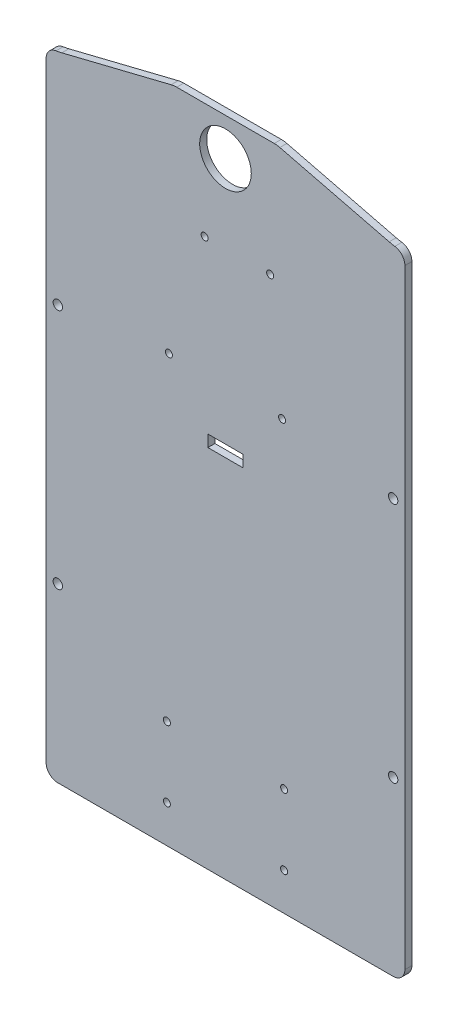
ISO-10303-21;
HEADER;
FILE_DESCRIPTION(('STEP AP214'),'2;1');
FILE_NAME('part.step','',(''),(''),'','','');
FILE_SCHEMA(('AUTOMOTIVE_DESIGN { 1 0 10303 214 1 1 1 1 }'));
ENDSEC;
DATA;
#1=APPLICATION_CONTEXT('core data for automotive mechanical design processes');
#2=APPLICATION_PROTOCOL_DEFINITION('international standard','automotive_design',2000,#1);
#3=PRODUCT_CONTEXT('',#1,'mechanical');
#4=PRODUCT('Part','Part','',(#3));
#5=PRODUCT_RELATED_PRODUCT_CATEGORY('part','',(#4));
#6=PRODUCT_DEFINITION_FORMATION('','',#4);
#7=PRODUCT_DEFINITION_CONTEXT('part definition',#1,'design');
#8=PRODUCT_DEFINITION('design','',#6,#7);
#9=PRODUCT_DEFINITION_SHAPE('','',#8);
#10=(LENGTH_UNIT() NAMED_UNIT(*) SI_UNIT(.MILLI.,.METRE.));
#11=(NAMED_UNIT(*) PLANE_ANGLE_UNIT() SI_UNIT($,.RADIAN.));
#12=(NAMED_UNIT(*) SI_UNIT($,.STERADIAN.) SOLID_ANGLE_UNIT());
#13=UNCERTAINTY_MEASURE_WITH_UNIT(LENGTH_MEASURE(1.E-05),#10,'distance_accuracy_value','');
#14=(GEOMETRIC_REPRESENTATION_CONTEXT(3) GLOBAL_UNCERTAINTY_ASSIGNED_CONTEXT((#13)) GLOBAL_UNIT_ASSIGNED_CONTEXT((#10,
#11,#12)) REPRESENTATION_CONTEXT('',''));
#15=CARTESIAN_POINT('',(0.,0.,0.));
#16=DIRECTION('',(0.,0.,1.));
#17=DIRECTION('',(1.,0.,0.));
#18=AXIS2_PLACEMENT_3D('',#15,#16,#17);
#19=CARTESIAN_POINT('',(76.5,135.,3.));
#20=DIRECTION('',(-1.,0.,0.));
#21=DIRECTION('',(0.,-1.,0.));
#22=AXIS2_PLACEMENT_3D('',#19,#20,#21);
#23=PLANE('',#22);
#24=DIRECTION('',(0.,1.,0.));
#25=VECTOR('',#24,1.);
#26=CARTESIAN_POINT('',(76.5,135.,3.));
#27=LINE('',#26,#25);
#28=CARTESIAN_POINT('',(76.5,-130.,3.));
#29=VERTEX_POINT('',#28);
#30=CARTESIAN_POINT('',(76.5,130.,3.));
#31=VERTEX_POINT('',#30);
#32=EDGE_CURVE('E289',#29,#31,#27,.T.);
#33=ORIENTED_EDGE('',*,*,#32,.F.);
#34=DIRECTION('',(0.,0.,-1.));
#35=VECTOR('',#34,1.);
#36=CARTESIAN_POINT('',(76.5,-130.,3.));
#37=LINE('',#36,#35);
#38=CARTESIAN_POINT('',(76.5,-130.,0.));
#39=VERTEX_POINT('',#38);
#40=EDGE_CURVE('E355',#29,#39,#37,.T.);
#41=ORIENTED_EDGE('',*,*,#40,.T.);
#42=DIRECTION('',(0.,1.,0.));
#43=VECTOR('',#42,1.);
#44=CARTESIAN_POINT('',(76.5,135.,0.));
#45=LINE('',#44,#43);
#46=CARTESIAN_POINT('',(76.5,130.,0.));
#47=VERTEX_POINT('',#46);
#48=EDGE_CURVE('E285',#39,#47,#45,.T.);
#49=ORIENTED_EDGE('',*,*,#48,.T.);
#50=DIRECTION('',(0.,0.,-1.));
#51=VECTOR('',#50,1.);
#52=CARTESIAN_POINT('',(76.5,130.,3.));
#53=LINE('',#52,#51);
#54=EDGE_CURVE('E352',#47,#31,#53,.F.);
#55=ORIENTED_EDGE('',*,*,#54,.T.);
#56=EDGE_LOOP('',(#33,#41,#49,#55));
#57=FACE_BOUND('',#56,.T.);
#58=ADVANCED_FACE('F39',(#57),#23,.F.);
#59=CARTESIAN_POINT('',(-76.5,135.,3.));
#60=DIRECTION('',(1.,0.,0.));
#61=DIRECTION('',(0.,1.,0.));
#62=AXIS2_PLACEMENT_3D('',#59,#60,#61);
#63=PLANE('',#62);
#64=DIRECTION('',(0.,-1.,0.));
#65=VECTOR('',#64,1.);
#66=CARTESIAN_POINT('',(-76.5,135.,0.));
#67=LINE('',#66,#65);
#68=CARTESIAN_POINT('',(-76.5,130.,0.));
#69=VERTEX_POINT('',#68);
#70=CARTESIAN_POINT('',(-76.5,-130.,0.));
#71=VERTEX_POINT('',#70);
#72=EDGE_CURVE('E306',#69,#71,#67,.T.);
#73=ORIENTED_EDGE('',*,*,#72,.T.);
#74=DIRECTION('',(0.,0.,-1.));
#75=VECTOR('',#74,1.);
#76=CARTESIAN_POINT('',(-76.5,-130.,3.));
#77=LINE('',#76,#75);
#78=CARTESIAN_POINT('',(-76.5,-130.,3.));
#79=VERTEX_POINT('',#78);
#80=EDGE_CURVE('E336',#71,#79,#77,.F.);
#81=ORIENTED_EDGE('',*,*,#80,.T.);
#82=DIRECTION('',(0.,-1.,0.));
#83=VECTOR('',#82,1.);
#84=CARTESIAN_POINT('',(-76.5,135.,3.));
#85=LINE('',#84,#83);
#86=CARTESIAN_POINT('',(-76.5,130.,3.));
#87=VERTEX_POINT('',#86);
#88=EDGE_CURVE('E293',#87,#79,#85,.T.);
#89=ORIENTED_EDGE('',*,*,#88,.F.);
#90=DIRECTION('',(0.,0.,-1.));
#91=VECTOR('',#90,1.);
#92=CARTESIAN_POINT('',(-76.5,130.,3.));
#93=LINE('',#92,#91);
#94=EDGE_CURVE('E332',#87,#69,#93,.T.);
#95=ORIENTED_EDGE('',*,*,#94,.T.);
#96=EDGE_LOOP('',(#73,#81,#89,#95));
#97=FACE_BOUND('',#96,.T.);
#98=ADVANCED_FACE('F439',(#97),#63,.F.);
#99=CARTESIAN_POINT('',(-76.5,-135.,3.));
#100=DIRECTION('',(0.,1.,0.));
#101=DIRECTION('',(0.,0.,1.));
#102=AXIS2_PLACEMENT_3D('',#99,#100,#101);
#103=PLANE('',#102);
#104=DIRECTION('',(1.,0.,0.));
#105=VECTOR('',#104,1.);
#106=CARTESIAN_POINT('',(-76.5,-135.,3.));
#107=LINE('',#106,#105);
#108=CARTESIAN_POINT('',(-71.5,-135.,3.));
#109=VERTEX_POINT('',#108);
#110=CARTESIAN_POINT('',(71.5,-135.,3.));
#111=VERTEX_POINT('',#110);
#112=EDGE_CURVE('E298',#109,#111,#107,.T.);
#113=ORIENTED_EDGE('',*,*,#112,.F.);
#114=DIRECTION('',(0.,0.,-1.));
#115=VECTOR('',#114,1.);
#116=CARTESIAN_POINT('',(-71.5,-135.,3.));
#117=LINE('',#116,#115);
#118=CARTESIAN_POINT('',(-71.5,-135.,0.));
#119=VERTEX_POINT('',#118);
#120=EDGE_CURVE('E315',#109,#119,#117,.T.);
#121=ORIENTED_EDGE('',*,*,#120,.T.);
#122=DIRECTION('',(1.,0.,0.));
#123=VECTOR('',#122,1.);
#124=CARTESIAN_POINT('',(-76.5,-135.,0.));
#125=LINE('',#124,#123);
#126=CARTESIAN_POINT('',(71.5,-135.,0.));
#127=VERTEX_POINT('',#126);
#128=EDGE_CURVE('E294',#119,#127,#125,.T.);
#129=ORIENTED_EDGE('',*,*,#128,.T.);
#130=DIRECTION('',(0.,0.,-1.));
#131=VECTOR('',#130,1.);
#132=CARTESIAN_POINT('',(71.5,-135.,3.));
#133=LINE('',#132,#131);
#134=EDGE_CURVE('E302',#127,#111,#133,.F.);
#135=ORIENTED_EDGE('',*,*,#134,.T.);
#136=EDGE_LOOP('',(#113,#121,#129,#135));
#137=FACE_BOUND('',#136,.T.);
#138=ADVANCED_FACE('F445',(#137),#103,.F.);
#139=CARTESIAN_POINT('',(0.,0.,3.));
#140=DIRECTION('',(0.,0.,1.));
#141=DIRECTION('',(1.,0.,0.));
#142=AXIS2_PLACEMENT_3D('',#139,#140,#141);
#143=PLANE('',#142);
#144=CARTESIAN_POINT('',(25.,-89.0383951916944,3.));
#145=DIRECTION('',(0.,0.,1.));
#146=DIRECTION('',(1.,0.,0.));
#147=AXIS2_PLACEMENT_3D('',#144,#145,#146);
#148=CIRCLE('',#147,1.5);
#149=CARTESIAN_POINT('',(26.5,-89.0383951916944,3.));
#150=VERTEX_POINT('',#149);
#151=EDGE_CURVE('E759',#150,#150,#148,.T.);
#152=ORIENTED_EDGE('',*,*,#151,.F.);
#153=EDGE_LOOP('',(#152));
#154=FACE_BOUND('',#153,.T.);
#155=CARTESIAN_POINT('',(-25.,-119.038395191694,3.));
#156=DIRECTION('',(0.,0.,1.));
#157=DIRECTION('',(1.,0.,0.));
#158=AXIS2_PLACEMENT_3D('',#155,#156,#157);
#159=CIRCLE('',#158,1.5);
#160=CARTESIAN_POINT('',(-23.5,-119.038395191694,3.));
#161=VERTEX_POINT('',#160);
#162=EDGE_CURVE('E755',#161,#161,#159,.T.);
#163=ORIENTED_EDGE('',*,*,#162,.F.);
#164=EDGE_LOOP('',(#163));
#165=FACE_BOUND('',#164,.T.);
#166=CARTESIAN_POINT('',(25.,-119.038395191694,3.));
#167=DIRECTION('',(0.,0.,1.));
#168=DIRECTION('',(1.,0.,0.));
#169=AXIS2_PLACEMENT_3D('',#166,#167,#168);
#170=CIRCLE('',#169,1.5);
#171=CARTESIAN_POINT('',(26.5,-119.038395191694,3.));
#172=VERTEX_POINT('',#171);
#173=EDGE_CURVE('E747',#172,#172,#170,.T.);
#174=ORIENTED_EDGE('',*,*,#173,.F.);
#175=EDGE_LOOP('',(#174));
#176=FACE_BOUND('',#175,.T.);
#177=CARTESIAN_POINT('',(-25.,-89.0383951916944,3.));
#178=DIRECTION('',(0.,0.,1.));
#179=DIRECTION('',(1.,0.,0.));
#180=AXIS2_PLACEMENT_3D('',#177,#178,#179);
#181=CIRCLE('',#180,1.5);
#182=CARTESIAN_POINT('',(-23.5,-89.0383951916944,3.));
#183=VERTEX_POINT('',#182);
#184=EDGE_CURVE('E412',#183,#183,#181,.T.);
#185=ORIENTED_EDGE('',*,*,#184,.F.);
#186=EDGE_LOOP('',(#185));
#187=FACE_BOUND('',#186,.T.);
#188=DIRECTION('',(0.,-1.,0.));
#189=VECTOR('',#188,1.);
#190=CARTESIAN_POINT('',(-7.49999999999998,25.7976680121043,3.));
#191=LINE('',#190,#189);
#192=CARTESIAN_POINT('',(-7.49999999999998,25.7976680121043,3.));
#193=VERTEX_POINT('',#192);
#194=CARTESIAN_POINT('',(-7.49999999999998,20.7976680121043,3.));
#195=VERTEX_POINT('',#194);
#196=EDGE_CURVE('E57',#193,#195,#191,.T.);
#197=ORIENTED_EDGE('',*,*,#196,.F.);
#198=DIRECTION('',(-1.,0.,0.));
#199=VECTOR('',#198,1.);
#200=CARTESIAN_POINT('',(-7.49999999999998,25.7976680121043,3.));
#201=LINE('',#200,#199);
#202=CARTESIAN_POINT('',(7.50000000000001,25.7976680121043,3.));
#203=VERTEX_POINT('',#202);
#204=EDGE_CURVE('E187',#203,#193,#201,.T.);
#205=ORIENTED_EDGE('',*,*,#204,.F.);
#206=DIRECTION('',(0.,1.,0.));
#207=VECTOR('',#206,1.);
#208=CARTESIAN_POINT('',(7.50000000000001,25.7976680121043,3.));
#209=LINE('',#208,#207);
#210=CARTESIAN_POINT('',(7.50000000000002,20.7976680121043,3.));
#211=VERTEX_POINT('',#210);
#212=EDGE_CURVE('E191',#211,#203,#209,.T.);
#213=ORIENTED_EDGE('',*,*,#212,.F.);
#214=DIRECTION('',(1.,0.,0.));
#215=VECTOR('',#214,1.);
#216=CARTESIAN_POINT('',(-7.49999999999998,20.7976680121043,3.));
#217=LINE('',#216,#215);
#218=EDGE_CURVE('E203',#195,#211,#217,.T.);
#219=ORIENTED_EDGE('',*,*,#218,.F.);
#220=EDGE_LOOP('',(#197,#205,#213,#219));
#221=FACE_BOUND('',#220,.T.);
#222=CARTESIAN_POINT('',(-24.13,47.2200591996396,3.));
#223=DIRECTION('',(0.,0.,1.));
#224=DIRECTION('',(1.,0.,0.));
#225=AXIS2_PLACEMENT_3D('',#222,#223,#224);
#226=CIRCLE('',#225,1.5);
#227=CARTESIAN_POINT('',(-22.63,47.2200591996396,3.));
#228=VERTEX_POINT('',#227);
#229=EDGE_CURVE('E194',#228,#228,#226,.T.);
#230=ORIENTED_EDGE('',*,*,#229,.F.);
#231=EDGE_LOOP('',(#230));
#232=FACE_BOUND('',#231,.T.);
#233=CARTESIAN_POINT('',(24.13,47.2200591996397,3.));
#234=DIRECTION('',(0.,0.,1.));
#235=DIRECTION('',(1.,0.,0.));
#236=AXIS2_PLACEMENT_3D('',#233,#234,#235);
#237=CIRCLE('',#236,1.5);
#238=CARTESIAN_POINT('',(25.63,47.2200591996397,3.));
#239=VERTEX_POINT('',#238);
#240=EDGE_CURVE('E778',#239,#239,#237,.T.);
#241=ORIENTED_EDGE('',*,*,#240,.F.);
#242=EDGE_LOOP('',(#241));
#243=FACE_BOUND('',#242,.T.);
#244=CARTESIAN_POINT('',(19.05,98.0200591996396,3.));
#245=DIRECTION('',(0.,0.,1.));
#246=DIRECTION('',(1.,0.,0.));
#247=AXIS2_PLACEMENT_3D('',#244,#245,#246);
#248=CIRCLE('',#247,1.5);
#249=CARTESIAN_POINT('',(20.55,98.0200591996396,3.));
#250=VERTEX_POINT('',#249);
#251=EDGE_CURVE('E770',#250,#250,#248,.T.);
#252=ORIENTED_EDGE('',*,*,#251,.F.);
#253=EDGE_LOOP('',(#252));
#254=FACE_BOUND('',#253,.T.);
#255=CARTESIAN_POINT('',(-8.88999999999999,98.0200591996397,3.));
#256=DIRECTION('',(0.,0.,1.));
#257=DIRECTION('',(1.,0.,0.));
#258=AXIS2_PLACEMENT_3D('',#255,#256,#257);
#259=CIRCLE('',#258,1.5);
#260=CARTESIAN_POINT('',(-7.38999999999999,98.0200591996397,3.));
#261=VERTEX_POINT('',#260);
#262=EDGE_CURVE('E222',#261,#261,#259,.T.);
#263=ORIENTED_EDGE('',*,*,#262,.F.);
#264=EDGE_LOOP('',(#263));
#265=FACE_BOUND('',#264,.T.);
#266=CARTESIAN_POINT('',(0.,131.2375,3.));
#267=DIRECTION('',(0.,0.,1.));
#268=DIRECTION('',(1.,0.,0.));
#269=AXIS2_PLACEMENT_3D('',#266,#267,#268);
#270=CIRCLE('',#269,11.);
#271=CARTESIAN_POINT('',(11.,131.2375,3.));
#272=VERTEX_POINT('',#271);
#273=EDGE_CURVE('E221',#272,#272,#270,.T.);
#274=ORIENTED_EDGE('',*,*,#273,.F.);
#275=EDGE_LOOP('',(#274));
#276=FACE_BOUND('',#275,.T.);
#277=CARTESIAN_POINT('',(71.5,41.5,3.));
#278=DIRECTION('',(0.,0.,1.));
#279=DIRECTION('',(-1.,0.,0.));
#280=AXIS2_PLACEMENT_3D('',#277,#278,#279);
#281=CIRCLE('',#280,2.);
#282=CARTESIAN_POINT('',(69.5,41.5,3.));
#283=VERTEX_POINT('',#282);
#284=EDGE_CURVE('E256',#283,#283,#281,.T.);
#285=ORIENTED_EDGE('',*,*,#284,.F.);
#286=EDGE_LOOP('',(#285));
#287=FACE_BOUND('',#286,.T.);
#288=CARTESIAN_POINT('',(71.5,-61.5,3.));
#289=DIRECTION('',(0.,0.,1.));
#290=DIRECTION('',(1.,0.,0.));
#291=AXIS2_PLACEMENT_3D('',#288,#289,#290);
#292=CIRCLE('',#291,2.);
#293=CARTESIAN_POINT('',(73.5000000000001,-61.5,3.));
#294=VERTEX_POINT('',#293);
#295=EDGE_CURVE('E270',#294,#294,#292,.T.);
#296=ORIENTED_EDGE('',*,*,#295,.F.);
#297=EDGE_LOOP('',(#296));
#298=FACE_BOUND('',#297,.T.);
#299=CARTESIAN_POINT('',(-71.5,-61.5,3.));
#300=DIRECTION('',(0.,0.,1.));
#301=DIRECTION('',(-1.,0.,0.));
#302=AXIS2_PLACEMENT_3D('',#299,#300,#301);
#303=CIRCLE('',#302,2.);
#304=CARTESIAN_POINT('',(-73.5,-61.5,3.));
#305=VERTEX_POINT('',#304);
#306=EDGE_CURVE('E262',#305,#305,#303,.T.);
#307=ORIENTED_EDGE('',*,*,#306,.F.);
#308=EDGE_LOOP('',(#307));
#309=FACE_BOUND('',#308,.T.);
#310=CARTESIAN_POINT('',(-71.5,41.5,3.));
#311=DIRECTION('',(0.,0.,1.));
#312=DIRECTION('',(1.,0.,0.));
#313=AXIS2_PLACEMENT_3D('',#310,#311,#312);
#314=CIRCLE('',#313,2.);
#315=CARTESIAN_POINT('',(-69.5,41.5,3.));
#316=VERTEX_POINT('',#315);
#317=EDGE_CURVE('E261',#316,#316,#314,.T.);
#318=ORIENTED_EDGE('',*,*,#317,.F.);
#319=EDGE_LOOP('',(#318));
#320=FACE_BOUND('',#319,.T.);
#321=DIRECTION('',(-0.970773672969585,0.23999682470637,0.));
#322=VECTOR('',#321,1.);
#323=CARTESIAN_POINT('',(22.,147.2375,3.));
#324=LINE('',#323,#322);
#325=CARTESIAN_POINT('',(69.7938929549953,135.421787575015,3.));
#326=VERTEX_POINT('',#325);
#327=CARTESIAN_POINT('',(23.1821885090955,146.945236729696,3.));
#328=VERTEX_POINT('',#327);
#329=EDGE_CURVE('E231',#326,#328,#324,.T.);
#330=ORIENTED_EDGE('',*,*,#329,.T.);
#331=CARTESIAN_POINT('',(20.7822202620318,137.2375,3.));
#332=DIRECTION('',(0.,0.,1.));
#333=DIRECTION('',(1.,0.,0.));
#334=AXIS2_PLACEMENT_3D('',#331,#332,#333);
#335=CIRCLE('',#334,10.);
#336=CARTESIAN_POINT('',(20.7822202620318,147.2375,3.));
#337=VERTEX_POINT('',#336);
#338=EDGE_CURVE('E392',#328,#337,#335,.T.);
#339=ORIENTED_EDGE('',*,*,#338,.T.);
#340=DIRECTION('',(-1.,0.,0.));
#341=VECTOR('',#340,1.);
#342=CARTESIAN_POINT('',(22.,147.2375,3.));
#343=LINE('',#342,#341);
#344=CARTESIAN_POINT('',(-20.7822202620317,147.2375,3.));
#345=VERTEX_POINT('',#344);
#346=EDGE_CURVE('E247',#337,#345,#343,.T.);
#347=ORIENTED_EDGE('',*,*,#346,.T.);
#348=CARTESIAN_POINT('',(-20.7822202620317,137.2375,3.));
#349=DIRECTION('',(0.,0.,1.));
#350=DIRECTION('',(1.,0.,0.));
#351=AXIS2_PLACEMENT_3D('',#348,#349,#350);
#352=CIRCLE('',#351,10.);
#353=CARTESIAN_POINT('',(-23.1821885090955,146.945236729696,3.));
#354=VERTEX_POINT('',#353);
#355=EDGE_CURVE('E389',#345,#354,#352,.T.);
#356=ORIENTED_EDGE('',*,*,#355,.T.);
#357=DIRECTION('',(-0.970773672969585,-0.23999682470637,0.));
#358=VECTOR('',#357,1.);
#359=CARTESIAN_POINT('',(-22.,147.2375,3.));
#360=LINE('',#359,#358);
#361=CARTESIAN_POINT('',(-69.7938929549951,135.421787575015,3.));
#362=VERTEX_POINT('',#361);
#363=EDGE_CURVE('E240',#354,#362,#360,.T.);
#364=ORIENTED_EDGE('',*,*,#363,.T.);
#365=CARTESIAN_POINT('',(-75.7938135726544,159.691129399255,3.));
#366=DIRECTION('',(0.,0.,1.));
#367=DIRECTION('',(1.,0.,0.));
#368=AXIS2_PLACEMENT_3D('',#365,#366,#367);
#369=CIRCLE('',#368,25.);
#370=CARTESIAN_POINT('',(-72.2156355954424,134.948521566542,3.));
#371=VERTEX_POINT('',#370);
#372=EDGE_CURVE('E379',#362,#371,#369,.F.);
#373=ORIENTED_EDGE('',*,*,#372,.T.);
#374=CARTESIAN_POINT('',(-71.5,130.,3.));
#375=DIRECTION('',(0.,0.,1.));
#376=DIRECTION('',(1.,0.,0.));
#377=AXIS2_PLACEMENT_3D('',#374,#375,#376);
#378=CIRCLE('',#377,5.);
#379=EDGE_CURVE('E339',#371,#87,#378,.T.);
#380=ORIENTED_EDGE('',*,*,#379,.T.);
#381=ORIENTED_EDGE('',*,*,#88,.T.);
#382=CARTESIAN_POINT('',(-71.5,-130.,3.));
#383=DIRECTION('',(0.,0.,1.));
#384=DIRECTION('',(1.,0.,0.));
#385=AXIS2_PLACEMENT_3D('',#382,#383,#384);
#386=CIRCLE('',#385,5.);
#387=EDGE_CURVE('E349',#79,#109,#386,.T.);
#388=ORIENTED_EDGE('',*,*,#387,.T.);
#389=ORIENTED_EDGE('',*,*,#112,.T.);
#390=CARTESIAN_POINT('',(71.5,-130.,3.));
#391=DIRECTION('',(0.,0.,1.));
#392=DIRECTION('',(1.,0.,0.));
#393=AXIS2_PLACEMENT_3D('',#390,#391,#392);
#394=CIRCLE('',#393,5.);
#395=EDGE_CURVE('E346',#111,#29,#394,.T.);
#396=ORIENTED_EDGE('',*,*,#395,.T.);
#397=ORIENTED_EDGE('',*,*,#32,.T.);
#398=CARTESIAN_POINT('',(71.5,130.,3.));
#399=DIRECTION('',(0.,0.,1.));
#400=DIRECTION('',(1.,0.,0.));
#401=AXIS2_PLACEMENT_3D('',#398,#399,#400);
#402=CIRCLE('',#401,5.);
#403=CARTESIAN_POINT('',(72.2156355954424,134.948521566542,3.));
#404=VERTEX_POINT('',#403);
#405=EDGE_CURVE('E342',#31,#404,#402,.T.);
#406=ORIENTED_EDGE('',*,*,#405,.T.);
#407=CARTESIAN_POINT('',(75.7938135726546,159.691129399255,3.));
#408=DIRECTION('',(0.,0.,1.));
#409=DIRECTION('',(1.,0.,0.));
#410=AXIS2_PLACEMENT_3D('',#407,#408,#409);
#411=CIRCLE('',#410,25.);
#412=EDGE_CURVE('E376',#404,#326,#411,.F.);
#413=ORIENTED_EDGE('',*,*,#412,.T.);
#414=EDGE_LOOP('',(#330,#339,#347,#356,#364,#373,#380,#381,#388,#389,#396,#397,#406,#413));
#415=FACE_BOUND('',#414,.T.);
#416=ADVANCED_FACE('F503',(#154,#165,#176,#187,#221,#232,#243,#254,#265,#276,#287,#298,#309,
#320,#415),#143,.T.);
#417=CARTESIAN_POINT('',(0.,0.,0.));
#418=DIRECTION('',(0.,0.,1.));
#419=DIRECTION('',(1.,0.,0.));
#420=AXIS2_PLACEMENT_3D('',#417,#418,#419);
#421=PLANE('',#420);
#422=CARTESIAN_POINT('',(25.,-89.0383951916944,0.));
#423=DIRECTION('',(0.,0.,1.));
#424=DIRECTION('',(1.,0.,0.));
#425=AXIS2_PLACEMENT_3D('',#422,#423,#424);
#426=CIRCLE('',#425,1.5);
#427=CARTESIAN_POINT('',(26.5,-89.0383951916944,0.));
#428=VERTEX_POINT('',#427);
#429=EDGE_CURVE('E43',#428,#428,#426,.T.);
#430=ORIENTED_EDGE('',*,*,#429,.T.);
#431=EDGE_LOOP('',(#430));
#432=FACE_BOUND('',#431,.T.);
#433=CARTESIAN_POINT('',(-25.,-119.038395191694,0.));
#434=DIRECTION('',(0.,0.,1.));
#435=DIRECTION('',(1.,0.,0.));
#436=AXIS2_PLACEMENT_3D('',#433,#434,#435);
#437=CIRCLE('',#436,1.5);
#438=CARTESIAN_POINT('',(-23.5,-119.038395191694,0.));
#439=VERTEX_POINT('',#438);
#440=EDGE_CURVE('E415',#439,#439,#437,.T.);
#441=ORIENTED_EDGE('',*,*,#440,.T.);
#442=EDGE_LOOP('',(#441));
#443=FACE_BOUND('',#442,.T.);
#444=CARTESIAN_POINT('',(25.,-119.038395191694,0.));
#445=DIRECTION('',(0.,0.,1.));
#446=DIRECTION('',(1.,0.,0.));
#447=AXIS2_PLACEMENT_3D('',#444,#445,#446);
#448=CIRCLE('',#447,1.5);
#449=CARTESIAN_POINT('',(26.5,-119.038395191694,0.));
#450=VERTEX_POINT('',#449);
#451=EDGE_CURVE('E411',#450,#450,#448,.T.);
#452=ORIENTED_EDGE('',*,*,#451,.T.);
#453=EDGE_LOOP('',(#452));
#454=FACE_BOUND('',#453,.T.);
#455=CARTESIAN_POINT('',(-25.,-89.0383951916944,0.));
#456=DIRECTION('',(0.,0.,1.));
#457=DIRECTION('',(1.,0.,0.));
#458=AXIS2_PLACEMENT_3D('',#455,#456,#457);
#459=CIRCLE('',#458,1.5);
#460=CARTESIAN_POINT('',(-23.5,-89.0383951916944,0.));
#461=VERTEX_POINT('',#460);
#462=EDGE_CURVE('E407',#461,#461,#459,.T.);
#463=ORIENTED_EDGE('',*,*,#462,.T.);
#464=EDGE_LOOP('',(#463));
#465=FACE_BOUND('',#464,.T.);
#466=DIRECTION('',(-1.,0.,0.));
#467=VECTOR('',#466,1.);
#468=CARTESIAN_POINT('',(-7.49999999999998,25.7976680121043,0.));
#469=LINE('',#468,#467);
#470=CARTESIAN_POINT('',(7.50000000000001,25.7976680121043,0.));
#471=VERTEX_POINT('',#470);
#472=CARTESIAN_POINT('',(-7.49999999999998,25.7976680121043,0.));
#473=VERTEX_POINT('',#472);
#474=EDGE_CURVE('E175',#471,#473,#469,.T.);
#475=ORIENTED_EDGE('',*,*,#474,.T.);
#476=DIRECTION('',(0.,-1.,0.));
#477=VECTOR('',#476,1.);
#478=CARTESIAN_POINT('',(-7.49999999999998,25.7976680121043,0.));
#479=LINE('',#478,#477);
#480=CARTESIAN_POINT('',(-7.49999999999998,20.7976680121043,0.));
#481=VERTEX_POINT('',#480);
#482=EDGE_CURVE('E168',#473,#481,#479,.T.);
#483=ORIENTED_EDGE('',*,*,#482,.T.);
#484=DIRECTION('',(1.,0.,0.));
#485=VECTOR('',#484,1.);
#486=CARTESIAN_POINT('',(-7.49999999999998,20.7976680121043,0.));
#487=LINE('',#486,#485);
#488=CARTESIAN_POINT('',(7.50000000000002,20.7976680121043,0.));
#489=VERTEX_POINT('',#488);
#490=EDGE_CURVE('E178',#481,#489,#487,.T.);
#491=ORIENTED_EDGE('',*,*,#490,.T.);
#492=DIRECTION('',(0.,1.,0.));
#493=VECTOR('',#492,1.);
#494=CARTESIAN_POINT('',(7.50000000000001,25.7976680121043,0.));
#495=LINE('',#494,#493);
#496=EDGE_CURVE('E65',#489,#471,#495,.T.);
#497=ORIENTED_EDGE('',*,*,#496,.T.);
#498=EDGE_LOOP('',(#475,#483,#491,#497));
#499=FACE_BOUND('',#498,.T.);
#500=CARTESIAN_POINT('',(-24.13,47.2200591996396,0.));
#501=DIRECTION('',(0.,0.,1.));
#502=DIRECTION('',(1.,0.,0.));
#503=AXIS2_PLACEMENT_3D('',#500,#501,#502);
#504=CIRCLE('',#503,1.5);
#505=CARTESIAN_POINT('',(-22.63,47.2200591996396,0.));
#506=VERTEX_POINT('',#505);
#507=EDGE_CURVE('E781',#506,#506,#504,.T.);
#508=ORIENTED_EDGE('',*,*,#507,.T.);
#509=EDGE_LOOP('',(#508));
#510=FACE_BOUND('',#509,.T.);
#511=CARTESIAN_POINT('',(24.13,47.2200591996397,0.));
#512=DIRECTION('',(0.,0.,1.));
#513=DIRECTION('',(1.,0.,0.));
#514=AXIS2_PLACEMENT_3D('',#511,#512,#513);
#515=CIRCLE('',#514,1.5);
#516=CARTESIAN_POINT('',(25.63,47.2200591996397,0.));
#517=VERTEX_POINT('',#516);
#518=EDGE_CURVE('E774',#517,#517,#515,.T.);
#519=ORIENTED_EDGE('',*,*,#518,.T.);
#520=EDGE_LOOP('',(#519));
#521=FACE_BOUND('',#520,.T.);
#522=CARTESIAN_POINT('',(19.05,98.0200591996396,0.));
#523=DIRECTION('',(0.,0.,1.));
#524=DIRECTION('',(1.,0.,0.));
#525=AXIS2_PLACEMENT_3D('',#522,#523,#524);
#526=CIRCLE('',#525,1.5);
#527=CARTESIAN_POINT('',(20.55,98.0200591996396,0.));
#528=VERTEX_POINT('',#527);
#529=EDGE_CURVE('E226',#528,#528,#526,.T.);
#530=ORIENTED_EDGE('',*,*,#529,.T.);
#531=EDGE_LOOP('',(#530));
#532=FACE_BOUND('',#531,.T.);
#533=CARTESIAN_POINT('',(-8.88999999999999,98.0200591996397,0.));
#534=DIRECTION('',(0.,0.,1.));
#535=DIRECTION('',(1.,0.,0.));
#536=AXIS2_PLACEMENT_3D('',#533,#534,#535);
#537=CIRCLE('',#536,1.5);
#538=CARTESIAN_POINT('',(-7.38999999999999,98.0200591996397,0.));
#539=VERTEX_POINT('',#538);
#540=EDGE_CURVE('E217',#539,#539,#537,.T.);
#541=ORIENTED_EDGE('',*,*,#540,.T.);
#542=EDGE_LOOP('',(#541));
#543=FACE_BOUND('',#542,.T.);
#544=CARTESIAN_POINT('',(0.,131.2375,0.));
#545=DIRECTION('',(0.,0.,1.));
#546=DIRECTION('',(1.,0.,0.));
#547=AXIS2_PLACEMENT_3D('',#544,#545,#546);
#548=CIRCLE('',#547,11.);
#549=CARTESIAN_POINT('',(11.,131.2375,0.));
#550=VERTEX_POINT('',#549);
#551=EDGE_CURVE('E227',#550,#550,#548,.T.);
#552=ORIENTED_EDGE('',*,*,#551,.T.);
#553=EDGE_LOOP('',(#552));
#554=FACE_BOUND('',#553,.T.);
#555=CARTESIAN_POINT('',(71.5,41.5,0.));
#556=DIRECTION('',(0.,0.,1.));
#557=DIRECTION('',(-1.,0.,0.));
#558=AXIS2_PLACEMENT_3D('',#555,#556,#557);
#559=CIRCLE('',#558,2.);
#560=CARTESIAN_POINT('',(69.5,41.5,0.));
#561=VERTEX_POINT('',#560);
#562=EDGE_CURVE('E274',#561,#561,#559,.T.);
#563=ORIENTED_EDGE('',*,*,#562,.T.);
#564=EDGE_LOOP('',(#563));
#565=FACE_BOUND('',#564,.T.);
#566=CARTESIAN_POINT('',(71.5,-61.5,0.));
#567=DIRECTION('',(0.,0.,1.));
#568=DIRECTION('',(1.,0.,0.));
#569=AXIS2_PLACEMENT_3D('',#566,#567,#568);
#570=CIRCLE('',#569,2.);
#571=CARTESIAN_POINT('',(73.5000000000001,-61.5,0.));
#572=VERTEX_POINT('',#571);
#573=EDGE_CURVE('E266',#572,#572,#570,.T.);
#574=ORIENTED_EDGE('',*,*,#573,.T.);
#575=EDGE_LOOP('',(#574));
#576=FACE_BOUND('',#575,.T.);
#577=CARTESIAN_POINT('',(-71.5,-61.5,0.));
#578=DIRECTION('',(0.,0.,1.));
#579=DIRECTION('',(-1.,0.,0.));
#580=AXIS2_PLACEMENT_3D('',#577,#578,#579);
#581=CIRCLE('',#580,2.);
#582=CARTESIAN_POINT('',(-73.5,-61.5,0.));
#583=VERTEX_POINT('',#582);
#584=EDGE_CURVE('E257',#583,#583,#581,.T.);
#585=ORIENTED_EDGE('',*,*,#584,.T.);
#586=EDGE_LOOP('',(#585));
#587=FACE_BOUND('',#586,.T.);
#588=CARTESIAN_POINT('',(-71.5,41.5,0.));
#589=DIRECTION('',(0.,0.,1.));
#590=DIRECTION('',(1.,0.,0.));
#591=AXIS2_PLACEMENT_3D('',#588,#589,#590);
#592=CIRCLE('',#591,2.);
#593=CARTESIAN_POINT('',(-69.5,41.5,0.));
#594=VERTEX_POINT('',#593);
#595=EDGE_CURVE('E281',#594,#594,#592,.T.);
#596=ORIENTED_EDGE('',*,*,#595,.T.);
#597=EDGE_LOOP('',(#596));
#598=FACE_BOUND('',#597,.T.);
#599=DIRECTION('',(1.,0.,0.));
#600=VECTOR('',#599,1.);
#601=CARTESIAN_POINT('',(22.,147.2375,0.));
#602=LINE('',#601,#600);
#603=CARTESIAN_POINT('',(-20.7822202620317,147.2375,0.));
#604=VERTEX_POINT('',#603);
#605=CARTESIAN_POINT('',(20.7822202620318,147.2375,0.));
#606=VERTEX_POINT('',#605);
#607=EDGE_CURVE('E243',#604,#606,#602,.T.);
#608=ORIENTED_EDGE('',*,*,#607,.T.);
#609=CARTESIAN_POINT('',(20.7822202620318,137.2375,0.));
#610=DIRECTION('',(0.,0.,1.));
#611=DIRECTION('',(1.,0.,0.));
#612=AXIS2_PLACEMENT_3D('',#609,#610,#611);
#613=CIRCLE('',#612,10.);
#614=CARTESIAN_POINT('',(23.1821885090955,146.945236729696,0.));
#615=VERTEX_POINT('',#614);
#616=EDGE_CURVE('E49',#606,#615,#613,.F.);
#617=ORIENTED_EDGE('',*,*,#616,.T.);
#618=DIRECTION('',(0.970773672969586,-0.23999682470637,0.));
#619=VECTOR('',#618,1.);
#620=CARTESIAN_POINT('',(22.,147.2375,0.));
#621=LINE('',#620,#619);
#622=CARTESIAN_POINT('',(69.7938929549953,135.421787575015,0.));
#623=VERTEX_POINT('',#622);
#624=EDGE_CURVE('E239',#615,#623,#621,.T.);
#625=ORIENTED_EDGE('',*,*,#624,.T.);
#626=CARTESIAN_POINT('',(75.7938135726546,159.691129399255,0.));
#627=DIRECTION('',(0.,0.,1.));
#628=DIRECTION('',(1.,0.,0.));
#629=AXIS2_PLACEMENT_3D('',#626,#627,#628);
#630=CIRCLE('',#629,25.);
#631=CARTESIAN_POINT('',(72.2156355954424,134.948521566542,0.));
#632=VERTEX_POINT('',#631);
#633=EDGE_CURVE('E373',#623,#632,#630,.T.);
#634=ORIENTED_EDGE('',*,*,#633,.T.);
#635=CARTESIAN_POINT('',(71.5,130.,0.));
#636=DIRECTION('',(0.,0.,1.));
#637=DIRECTION('',(1.,0.,0.));
#638=AXIS2_PLACEMENT_3D('',#635,#636,#637);
#639=CIRCLE('',#638,5.);
#640=EDGE_CURVE('E323',#632,#47,#639,.F.);
#641=ORIENTED_EDGE('',*,*,#640,.T.);
#642=ORIENTED_EDGE('',*,*,#48,.F.);
#643=CARTESIAN_POINT('',(71.5,-130.,0.));
#644=DIRECTION('',(0.,0.,1.));
#645=DIRECTION('',(1.,0.,0.));
#646=AXIS2_PLACEMENT_3D('',#643,#644,#645);
#647=CIRCLE('',#646,5.);
#648=EDGE_CURVE('E326',#39,#127,#647,.F.);
#649=ORIENTED_EDGE('',*,*,#648,.T.);
#650=ORIENTED_EDGE('',*,*,#128,.F.);
#651=CARTESIAN_POINT('',(-71.5,-130.,0.));
#652=DIRECTION('',(0.,0.,1.));
#653=DIRECTION('',(1.,0.,0.));
#654=AXIS2_PLACEMENT_3D('',#651,#652,#653);
#655=CIRCLE('',#654,5.);
#656=EDGE_CURVE('E329',#119,#71,#655,.F.);
#657=ORIENTED_EDGE('',*,*,#656,.T.);
#658=ORIENTED_EDGE('',*,*,#72,.F.);
#659=CARTESIAN_POINT('',(-71.5,130.,0.));
#660=DIRECTION('',(0.,0.,1.));
#661=DIRECTION('',(1.,0.,0.));
#662=AXIS2_PLACEMENT_3D('',#659,#660,#661);
#663=CIRCLE('',#662,5.);
#664=CARTESIAN_POINT('',(-72.2156355954424,134.948521566542,0.));
#665=VERTEX_POINT('',#664);
#666=EDGE_CURVE('E319',#69,#665,#663,.F.);
#667=ORIENTED_EDGE('',*,*,#666,.T.);
#668=CARTESIAN_POINT('',(-75.7938135726544,159.691129399255,0.));
#669=DIRECTION('',(0.,0.,1.));
#670=DIRECTION('',(1.,0.,0.));
#671=AXIS2_PLACEMENT_3D('',#668,#669,#670);
#672=CIRCLE('',#671,25.);
#673=CARTESIAN_POINT('',(-69.7938929549951,135.421787575015,0.));
#674=VERTEX_POINT('',#673);
#675=EDGE_CURVE('E382',#665,#674,#672,.T.);
#676=ORIENTED_EDGE('',*,*,#675,.T.);
#677=DIRECTION('',(0.970773672969586,0.23999682470637,0.));
#678=VECTOR('',#677,1.);
#679=CARTESIAN_POINT('',(-22.,147.2375,0.));
#680=LINE('',#679,#678);
#681=CARTESIAN_POINT('',(-23.1821885090955,146.945236729696,0.));
#682=VERTEX_POINT('',#681);
#683=EDGE_CURVE('E235',#674,#682,#680,.T.);
#684=ORIENTED_EDGE('',*,*,#683,.T.);
#685=CARTESIAN_POINT('',(-20.7822202620317,137.2375,0.));
#686=DIRECTION('',(0.,0.,1.));
#687=DIRECTION('',(1.,0.,0.));
#688=AXIS2_PLACEMENT_3D('',#685,#686,#687);
#689=CIRCLE('',#688,10.);
#690=EDGE_CURVE('E402',#682,#604,#689,.F.);
#691=ORIENTED_EDGE('',*,*,#690,.T.);
#692=EDGE_LOOP('',(#608,#617,#625,#634,#641,#642,#649,#650,#657,#658,#667,#676,#684,#691));
#693=FACE_BOUND('',#692,.T.);
#694=ADVANCED_FACE('F183',(#432,#443,#454,#465,#499,#510,#521,#532,#543,#554,#565,#576,#587,
#598,#693),#421,.F.);
#695=CARTESIAN_POINT('',(-71.5,41.5,0.));
#696=DIRECTION('',(0.,0.,1.));
#697=DIRECTION('',(1.,0.,0.));
#698=AXIS2_PLACEMENT_3D('',#695,#696,#697);
#699=CYLINDRICAL_SURFACE('',#698,2.);
#700=ORIENTED_EDGE('',*,*,#595,.F.);
#701=EDGE_LOOP('',(#700));
#702=FACE_BOUND('',#701,.T.);
#703=ORIENTED_EDGE('',*,*,#317,.T.);
#704=EDGE_LOOP('',(#703));
#705=FACE_BOUND('',#704,.T.);
#706=ADVANCED_FACE('F543',(#702,#705),#699,.F.);
#707=CARTESIAN_POINT('',(-71.5,-61.5,0.));
#708=DIRECTION('',(0.,0.,1.));
#709=DIRECTION('',(1.,0.,0.));
#710=AXIS2_PLACEMENT_3D('',#707,#708,#709);
#711=CYLINDRICAL_SURFACE('',#710,2.);
#712=ORIENTED_EDGE('',*,*,#584,.F.);
#713=EDGE_LOOP('',(#712));
#714=FACE_BOUND('',#713,.T.);
#715=ORIENTED_EDGE('',*,*,#306,.T.);
#716=EDGE_LOOP('',(#715));
#717=FACE_BOUND('',#716,.T.);
#718=ADVANCED_FACE('F539',(#714,#717),#711,.F.);
#719=CARTESIAN_POINT('',(71.5,-61.5,0.));
#720=DIRECTION('',(0.,0.,1.));
#721=DIRECTION('',(1.,0.,0.));
#722=AXIS2_PLACEMENT_3D('',#719,#720,#721);
#723=CYLINDRICAL_SURFACE('',#722,2.);
#724=ORIENTED_EDGE('',*,*,#573,.F.);
#725=EDGE_LOOP('',(#724));
#726=FACE_BOUND('',#725,.T.);
#727=ORIENTED_EDGE('',*,*,#295,.T.);
#728=EDGE_LOOP('',(#727));
#729=FACE_BOUND('',#728,.T.);
#730=ADVANCED_FACE('F542',(#726,#729),#723,.F.);
#731=CARTESIAN_POINT('',(71.5,41.5,0.));
#732=DIRECTION('',(0.,0.,1.));
#733=DIRECTION('',(1.,0.,0.));
#734=AXIS2_PLACEMENT_3D('',#731,#732,#733);
#735=CYLINDRICAL_SURFACE('',#734,2.);
#736=ORIENTED_EDGE('',*,*,#562,.F.);
#737=EDGE_LOOP('',(#736));
#738=FACE_BOUND('',#737,.T.);
#739=ORIENTED_EDGE('',*,*,#284,.T.);
#740=EDGE_LOOP('',(#739));
#741=FACE_BOUND('',#740,.T.);
#742=ADVANCED_FACE('F455',(#738,#741),#735,.F.);
#743=CARTESIAN_POINT('',(-71.5,-130.,3.));
#744=DIRECTION('',(0.,0.,-1.));
#745=DIRECTION('',(-1.,0.,0.));
#746=AXIS2_PLACEMENT_3D('',#743,#744,#745);
#747=CYLINDRICAL_SURFACE('',#746,5.);
#748=ORIENTED_EDGE('',*,*,#387,.F.);
#749=ORIENTED_EDGE('',*,*,#80,.F.);
#750=ORIENTED_EDGE('',*,*,#656,.F.);
#751=ORIENTED_EDGE('',*,*,#120,.F.);
#752=EDGE_LOOP('',(#748,#749,#750,#751));
#753=FACE_BOUND('',#752,.T.);
#754=ADVANCED_FACE('F451',(#753),#747,.T.);
#755=CARTESIAN_POINT('',(71.5,-130.,3.));
#756=DIRECTION('',(0.,0.,-1.));
#757=DIRECTION('',(-1.,0.,0.));
#758=AXIS2_PLACEMENT_3D('',#755,#756,#757);
#759=CYLINDRICAL_SURFACE('',#758,5.);
#760=ORIENTED_EDGE('',*,*,#395,.F.);
#761=ORIENTED_EDGE('',*,*,#134,.F.);
#762=ORIENTED_EDGE('',*,*,#648,.F.);
#763=ORIENTED_EDGE('',*,*,#40,.F.);
#764=EDGE_LOOP('',(#760,#761,#762,#763));
#765=FACE_BOUND('',#764,.T.);
#766=ADVANCED_FACE('F454',(#765),#759,.T.);
#767=CARTESIAN_POINT('',(71.5,130.,3.));
#768=DIRECTION('',(0.,0.,-1.));
#769=DIRECTION('',(-1.,0.,0.));
#770=AXIS2_PLACEMENT_3D('',#767,#768,#769);
#771=CYLINDRICAL_SURFACE('',#770,5.);
#772=ORIENTED_EDGE('',*,*,#640,.F.);
#773=DIRECTION('',(0.,0.,-1.));
#774=VECTOR('',#773,1.);
#775=CARTESIAN_POINT('',(72.2156355954424,134.948521566542,3.));
#776=LINE('',#775,#774);
#777=EDGE_CURVE('E363',#632,#404,#776,.F.);
#778=ORIENTED_EDGE('',*,*,#777,.T.);
#779=ORIENTED_EDGE('',*,*,#405,.F.);
#780=ORIENTED_EDGE('',*,*,#54,.F.);
#781=EDGE_LOOP('',(#772,#778,#779,#780));
#782=FACE_BOUND('',#781,.T.);
#783=ADVANCED_FACE('F459',(#782),#771,.T.);
#784=CARTESIAN_POINT('',(-71.5,130.,3.));
#785=DIRECTION('',(0.,0.,-1.));
#786=DIRECTION('',(-1.,0.,0.));
#787=AXIS2_PLACEMENT_3D('',#784,#785,#786);
#788=CYLINDRICAL_SURFACE('',#787,5.);
#789=ORIENTED_EDGE('',*,*,#379,.F.);
#790=DIRECTION('',(0.,0.,-1.));
#791=VECTOR('',#790,1.);
#792=CARTESIAN_POINT('',(-72.2156355954424,134.948521566542,3.));
#793=LINE('',#792,#791);
#794=EDGE_CURVE('E370',#371,#665,#793,.T.);
#795=ORIENTED_EDGE('',*,*,#794,.T.);
#796=ORIENTED_EDGE('',*,*,#666,.F.);
#797=ORIENTED_EDGE('',*,*,#94,.F.);
#798=EDGE_LOOP('',(#789,#795,#796,#797));
#799=FACE_BOUND('',#798,.T.);
#800=ADVANCED_FACE('F463',(#799),#788,.T.);
#801=CARTESIAN_POINT('',(22.,147.2375,-143.522668614578));
#802=DIRECTION('',(0.23999682470637,0.970773672969586,0.));
#803=DIRECTION('',(-0.970773672969586,0.23999682470637,0.));
#804=AXIS2_PLACEMENT_3D('',#801,#802,#803);
#805=PLANE('',#804);
#806=ORIENTED_EDGE('',*,*,#624,.F.);
#807=DIRECTION('',(0.,0.,1.));
#808=VECTOR('',#807,1.);
#809=CARTESIAN_POINT('',(23.1821885090955,146.945236729696,-143.522668614578));
#810=LINE('',#809,#808);
#811=EDGE_CURVE('E385',#615,#328,#810,.T.);
#812=ORIENTED_EDGE('',*,*,#811,.T.);
#813=ORIENTED_EDGE('',*,*,#329,.F.);
#814=DIRECTION('',(0.,0.,1.));
#815=VECTOR('',#814,1.);
#816=CARTESIAN_POINT('',(69.7938929549953,135.421787575015,0.));
#817=LINE('',#816,#815);
#818=EDGE_CURVE('E359',#326,#623,#817,.F.);
#819=ORIENTED_EDGE('',*,*,#818,.T.);
#820=EDGE_LOOP('',(#806,#812,#813,#819));
#821=FACE_BOUND('',#820,.T.);
#822=ADVANCED_FACE('F467',(#821),#805,.T.);
#823=CARTESIAN_POINT('',(-22.,147.2375,-143.522668614578));
#824=DIRECTION('',(-0.23999682470637,0.970773672969586,0.));
#825=DIRECTION('',(-0.970773672969586,-0.23999682470637,0.));
#826=AXIS2_PLACEMENT_3D('',#823,#824,#825);
#827=PLANE('',#826);
#828=ORIENTED_EDGE('',*,*,#363,.F.);
#829=DIRECTION('',(0.,0.,1.));
#830=VECTOR('',#829,1.);
#831=CARTESIAN_POINT('',(-23.1821885090955,146.945236729696,-143.522668614578));
#832=LINE('',#831,#830);
#833=EDGE_CURVE('E11',#354,#682,#832,.F.);
#834=ORIENTED_EDGE('',*,*,#833,.T.);
#835=ORIENTED_EDGE('',*,*,#683,.F.);
#836=DIRECTION('',(0.,0.,1.));
#837=VECTOR('',#836,1.);
#838=CARTESIAN_POINT('',(-69.7938929549951,135.421787575015,3.));
#839=LINE('',#838,#837);
#840=EDGE_CURVE('E366',#674,#362,#839,.T.);
#841=ORIENTED_EDGE('',*,*,#840,.T.);
#842=EDGE_LOOP('',(#828,#834,#835,#841));
#843=FACE_BOUND('',#842,.T.);
#844=ADVANCED_FACE('F523',(#843),#827,.T.);
#845=CARTESIAN_POINT('',(22.,147.2375,-143.522668614578));
#846=DIRECTION('',(0.,1.,0.));
#847=DIRECTION('',(0.,0.,1.));
#848=AXIS2_PLACEMENT_3D('',#845,#846,#847);
#849=PLANE('',#848);
#850=ORIENTED_EDGE('',*,*,#346,.F.);
#851=DIRECTION('',(0.,0.,1.));
#852=VECTOR('',#851,1.);
#853=CARTESIAN_POINT('',(20.7822202620318,147.2375,-143.522668614578));
#854=LINE('',#853,#852);
#855=EDGE_CURVE('E399',#337,#606,#854,.F.);
#856=ORIENTED_EDGE('',*,*,#855,.T.);
#857=ORIENTED_EDGE('',*,*,#607,.F.);
#858=DIRECTION('',(0.,0.,1.));
#859=VECTOR('',#858,1.);
#860=CARTESIAN_POINT('',(-20.7822202620317,147.2375,-143.522668614578));
#861=LINE('',#860,#859);
#862=EDGE_CURVE('E395',#604,#345,#861,.T.);
#863=ORIENTED_EDGE('',*,*,#862,.T.);
#864=EDGE_LOOP('',(#850,#856,#857,#863));
#865=FACE_BOUND('',#864,.T.);
#866=ADVANCED_FACE('F473',(#865),#849,.T.);
#867=CARTESIAN_POINT('',(75.7938135726546,159.691129399255,3.));
#868=DIRECTION('',(0.,0.,-1.));
#869=DIRECTION('',(-1.,0.,0.));
#870=AXIS2_PLACEMENT_3D('',#867,#868,#869);
#871=CYLINDRICAL_SURFACE('',#870,25.);
#872=ORIENTED_EDGE('',*,*,#412,.F.);
#873=ORIENTED_EDGE('',*,*,#777,.F.);
#874=ORIENTED_EDGE('',*,*,#633,.F.);
#875=ORIENTED_EDGE('',*,*,#818,.F.);
#876=EDGE_LOOP('',(#872,#873,#874,#875));
#877=FACE_BOUND('',#876,.T.);
#878=ADVANCED_FACE('F469',(#877),#871,.F.);
#879=CARTESIAN_POINT('',(-75.7938135726544,159.691129399255,3.));
#880=DIRECTION('',(0.,0.,-1.));
#881=DIRECTION('',(-1.,0.,0.));
#882=AXIS2_PLACEMENT_3D('',#879,#880,#881);
#883=CYLINDRICAL_SURFACE('',#882,25.);
#884=ORIENTED_EDGE('',*,*,#675,.F.);
#885=ORIENTED_EDGE('',*,*,#794,.F.);
#886=ORIENTED_EDGE('',*,*,#372,.F.);
#887=ORIENTED_EDGE('',*,*,#840,.F.);
#888=EDGE_LOOP('',(#884,#885,#886,#887));
#889=FACE_BOUND('',#888,.T.);
#890=ADVANCED_FACE('F472',(#889),#883,.F.);
#891=CARTESIAN_POINT('',(20.7822202620318,137.2375,-143.522668614578));
#892=DIRECTION('',(0.,0.,1.));
#893=DIRECTION('',(1.,0.,0.));
#894=AXIS2_PLACEMENT_3D('',#891,#892,#893);
#895=CYLINDRICAL_SURFACE('',#894,10.);
#896=ORIENTED_EDGE('',*,*,#616,.F.);
#897=ORIENTED_EDGE('',*,*,#855,.F.);
#898=ORIENTED_EDGE('',*,*,#338,.F.);
#899=ORIENTED_EDGE('',*,*,#811,.F.);
#900=EDGE_LOOP('',(#896,#897,#898,#899));
#901=FACE_BOUND('',#900,.T.);
#902=ADVANCED_FACE('F476',(#901),#895,.T.);
#903=CARTESIAN_POINT('',(-20.7822202620317,137.2375,-143.522668614578));
#904=DIRECTION('',(0.,0.,1.));
#905=DIRECTION('',(1.,0.,0.));
#906=AXIS2_PLACEMENT_3D('',#903,#904,#905);
#907=CYLINDRICAL_SURFACE('',#906,10.);
#908=ORIENTED_EDGE('',*,*,#690,.F.);
#909=ORIENTED_EDGE('',*,*,#833,.F.);
#910=ORIENTED_EDGE('',*,*,#355,.F.);
#911=ORIENTED_EDGE('',*,*,#862,.F.);
#912=EDGE_LOOP('',(#908,#909,#910,#911));
#913=FACE_BOUND('',#912,.T.);
#914=ADVANCED_FACE('F41',(#913),#907,.T.);
#915=CARTESIAN_POINT('',(0.,131.2375,0.));
#916=DIRECTION('',(0.,0.,1.));
#917=DIRECTION('',(1.,0.,0.));
#918=AXIS2_PLACEMENT_3D('',#915,#916,#917);
#919=CYLINDRICAL_SURFACE('',#918,11.);
#920=ORIENTED_EDGE('',*,*,#551,.F.);
#921=EDGE_LOOP('',(#920));
#922=FACE_BOUND('',#921,.T.);
#923=ORIENTED_EDGE('',*,*,#273,.T.);
#924=EDGE_LOOP('',(#923));
#925=FACE_BOUND('',#924,.T.);
#926=ADVANCED_FACE('F483',(#922,#925),#919,.F.);
#927=CARTESIAN_POINT('',(-8.88999999999999,98.0200591996397,0.));
#928=DIRECTION('',(0.,0.,1.));
#929=DIRECTION('',(1.,0.,0.));
#930=AXIS2_PLACEMENT_3D('',#927,#928,#929);
#931=CYLINDRICAL_SURFACE('',#930,1.5);
#932=ORIENTED_EDGE('',*,*,#540,.F.);
#933=EDGE_LOOP('',(#932));
#934=FACE_BOUND('',#933,.T.);
#935=ORIENTED_EDGE('',*,*,#262,.T.);
#936=EDGE_LOOP('',(#935));
#937=FACE_BOUND('',#936,.T.);
#938=ADVANCED_FACE('F640',(#934,#937),#931,.F.);
#939=CARTESIAN_POINT('',(19.05,98.0200591996396,0.));
#940=DIRECTION('',(0.,0.,1.));
#941=DIRECTION('',(1.,0.,0.));
#942=AXIS2_PLACEMENT_3D('',#939,#940,#941);
#943=CYLINDRICAL_SURFACE('',#942,1.5);
#944=ORIENTED_EDGE('',*,*,#529,.F.);
#945=EDGE_LOOP('',(#944));
#946=FACE_BOUND('',#945,.T.);
#947=ORIENTED_EDGE('',*,*,#251,.T.);
#948=EDGE_LOOP('',(#947));
#949=FACE_BOUND('',#948,.T.);
#950=ADVANCED_FACE('F649',(#946,#949),#943,.F.);
#951=CARTESIAN_POINT('',(24.13,47.2200591996397,0.));
#952=DIRECTION('',(0.,0.,1.));
#953=DIRECTION('',(1.,0.,0.));
#954=AXIS2_PLACEMENT_3D('',#951,#952,#953);
#955=CYLINDRICAL_SURFACE('',#954,1.5);
#956=ORIENTED_EDGE('',*,*,#518,.F.);
#957=EDGE_LOOP('',(#956));
#958=FACE_BOUND('',#957,.T.);
#959=ORIENTED_EDGE('',*,*,#240,.T.);
#960=EDGE_LOOP('',(#959));
#961=FACE_BOUND('',#960,.T.);
#962=ADVANCED_FACE('F659',(#958,#961),#955,.F.);
#963=CARTESIAN_POINT('',(-24.13,47.2200591996396,0.));
#964=DIRECTION('',(0.,0.,1.));
#965=DIRECTION('',(1.,0.,0.));
#966=AXIS2_PLACEMENT_3D('',#963,#964,#965);
#967=CYLINDRICAL_SURFACE('',#966,1.5);
#968=ORIENTED_EDGE('',*,*,#507,.F.);
#969=EDGE_LOOP('',(#968));
#970=FACE_BOUND('',#969,.T.);
#971=ORIENTED_EDGE('',*,*,#229,.T.);
#972=EDGE_LOOP('',(#971));
#973=FACE_BOUND('',#972,.T.);
#974=ADVANCED_FACE('F669',(#970,#973),#967,.F.);
#975=CARTESIAN_POINT('',(-7.49999999999998,25.7976680121043,0.));
#976=DIRECTION('',(-1.,0.,0.));
#977=DIRECTION('',(0.,-1.,0.));
#978=AXIS2_PLACEMENT_3D('',#975,#976,#977);
#979=PLANE('',#978);
#980=ORIENTED_EDGE('',*,*,#196,.T.);
#981=DIRECTION('',(0.,0.,1.));
#982=VECTOR('',#981,1.);
#983=CARTESIAN_POINT('',(-7.49999999999998,20.7976680121043,0.));
#984=LINE('',#983,#982);
#985=EDGE_CURVE('E164',#481,#195,#984,.T.);
#986=ORIENTED_EDGE('',*,*,#985,.F.);
#987=ORIENTED_EDGE('',*,*,#482,.F.);
#988=DIRECTION('',(0.,0.,1.));
#989=VECTOR('',#988,1.);
#990=CARTESIAN_POINT('',(-7.49999999999998,25.7976680121043,0.));
#991=LINE('',#990,#989);
#992=EDGE_CURVE('E209',#473,#193,#991,.T.);
#993=ORIENTED_EDGE('',*,*,#992,.T.);
#994=EDGE_LOOP('',(#980,#986,#987,#993));
#995=FACE_BOUND('',#994,.T.);
#996=ADVANCED_FACE('F166',(#995),#979,.F.);
#997=CARTESIAN_POINT('',(-7.49999999999998,25.7976680121043,0.));
#998=DIRECTION('',(0.,1.,0.));
#999=DIRECTION('',(-1.,0.,0.));
#1000=AXIS2_PLACEMENT_3D('',#997,#998,#999);
#1001=PLANE('',#1000);
#1002=ORIENTED_EDGE('',*,*,#204,.T.);
#1003=ORIENTED_EDGE('',*,*,#992,.F.);
#1004=ORIENTED_EDGE('',*,*,#474,.F.);
#1005=DIRECTION('',(0.,0.,1.));
#1006=VECTOR('',#1005,1.);
#1007=CARTESIAN_POINT('',(7.50000000000001,25.7976680121043,0.));
#1008=LINE('',#1007,#1006);
#1009=EDGE_CURVE('E212',#471,#203,#1008,.T.);
#1010=ORIENTED_EDGE('',*,*,#1009,.T.);
#1011=EDGE_LOOP('',(#1002,#1003,#1004,#1010));
#1012=FACE_BOUND('',#1011,.T.);
#1013=ADVANCED_FACE('F688',(#1012),#1001,.F.);
#1014=CARTESIAN_POINT('',(7.50000000000001,25.7976680121043,0.));
#1015=DIRECTION('',(1.,0.,0.));
#1016=DIRECTION('',(0.,1.,0.));
#1017=AXIS2_PLACEMENT_3D('',#1014,#1015,#1016);
#1018=PLANE('',#1017);
#1019=ORIENTED_EDGE('',*,*,#212,.T.);
#1020=ORIENTED_EDGE('',*,*,#1009,.F.);
#1021=ORIENTED_EDGE('',*,*,#496,.F.);
#1022=DIRECTION('',(0.,0.,1.));
#1023=VECTOR('',#1022,1.);
#1024=CARTESIAN_POINT('',(7.50000000000002,20.7976680121043,0.));
#1025=LINE('',#1024,#1023);
#1026=EDGE_CURVE('E174',#489,#211,#1025,.T.);
#1027=ORIENTED_EDGE('',*,*,#1026,.T.);
#1028=EDGE_LOOP('',(#1019,#1020,#1021,#1027));
#1029=FACE_BOUND('',#1028,.T.);
#1030=ADVANCED_FACE('F697',(#1029),#1018,.F.);
#1031=CARTESIAN_POINT('',(-7.49999999999998,20.7976680121043,0.));
#1032=DIRECTION('',(0.,-1.,0.));
#1033=DIRECTION('',(1.,0.,0.));
#1034=AXIS2_PLACEMENT_3D('',#1031,#1032,#1033);
#1035=PLANE('',#1034);
#1036=ORIENTED_EDGE('',*,*,#218,.T.);
#1037=ORIENTED_EDGE('',*,*,#1026,.F.);
#1038=ORIENTED_EDGE('',*,*,#490,.F.);
#1039=ORIENTED_EDGE('',*,*,#985,.T.);
#1040=EDGE_LOOP('',(#1036,#1037,#1038,#1039));
#1041=FACE_BOUND('',#1040,.T.);
#1042=ADVANCED_FACE('F179',(#1041),#1035,.F.);
#1043=CARTESIAN_POINT('',(-25.,-89.0383951916944,-7.));
#1044=DIRECTION('',(0.,0.,1.));
#1045=DIRECTION('',(1.,0.,0.));
#1046=AXIS2_PLACEMENT_3D('',#1043,#1044,#1045);
#1047=CYLINDRICAL_SURFACE('',#1046,1.5);
#1048=ORIENTED_EDGE('',*,*,#184,.T.);
#1049=EDGE_LOOP('',(#1048));
#1050=FACE_BOUND('',#1049,.T.);
#1051=ORIENTED_EDGE('',*,*,#462,.F.);
#1052=EDGE_LOOP('',(#1051));
#1053=FACE_BOUND('',#1052,.T.);
#1054=ADVANCED_FACE('F713',(#1050,#1053),#1047,.F.);
#1055=CARTESIAN_POINT('',(25.,-119.038395191694,-7.));
#1056=DIRECTION('',(0.,0.,1.));
#1057=DIRECTION('',(1.,0.,0.));
#1058=AXIS2_PLACEMENT_3D('',#1055,#1056,#1057);
#1059=CYLINDRICAL_SURFACE('',#1058,1.5);
#1060=ORIENTED_EDGE('',*,*,#173,.T.);
#1061=EDGE_LOOP('',(#1060));
#1062=FACE_BOUND('',#1061,.T.);
#1063=ORIENTED_EDGE('',*,*,#451,.F.);
#1064=EDGE_LOOP('',(#1063));
#1065=FACE_BOUND('',#1064,.T.);
#1066=ADVANCED_FACE('F433',(#1062,#1065),#1059,.F.);
#1067=CARTESIAN_POINT('',(-25.,-119.038395191694,-7.));
#1068=DIRECTION('',(0.,0.,1.));
#1069=DIRECTION('',(1.,0.,0.));
#1070=AXIS2_PLACEMENT_3D('',#1067,#1068,#1069);
#1071=CYLINDRICAL_SURFACE('',#1070,1.5);
#1072=ORIENTED_EDGE('',*,*,#162,.T.);
#1073=EDGE_LOOP('',(#1072));
#1074=FACE_BOUND('',#1073,.T.);
#1075=ORIENTED_EDGE('',*,*,#440,.F.);
#1076=EDGE_LOOP('',(#1075));
#1077=FACE_BOUND('',#1076,.T.);
#1078=ADVANCED_FACE('F427',(#1074,#1077),#1071,.F.);
#1079=CARTESIAN_POINT('',(25.,-89.0383951916944,-7.));
#1080=DIRECTION('',(0.,0.,1.));
#1081=DIRECTION('',(1.,0.,0.));
#1082=AXIS2_PLACEMENT_3D('',#1079,#1080,#1081);
#1083=CYLINDRICAL_SURFACE('',#1082,1.5);
#1084=ORIENTED_EDGE('',*,*,#151,.T.);
#1085=EDGE_LOOP('',(#1084));
#1086=FACE_BOUND('',#1085,.T.);
#1087=ORIENTED_EDGE('',*,*,#429,.F.);
#1088=EDGE_LOOP('',(#1087));
#1089=FACE_BOUND('',#1088,.T.);
#1090=ADVANCED_FACE('F425',(#1086,#1089),#1083,.F.);
#1091=CLOSED_SHELL('',(#58,#98,#138,#416,#694,#706,#718,#730,#742,#754,#766,#783,#800,#822,#844,
#866,#878,#890,#902,#914,#926,#938,#950,#962,#974,#996,#1013,#1030,#1042,#1054,#1066,#1078,#1090));
#1092=MANIFOLD_SOLID_BREP('B2',#1091);
#1093=ADVANCED_BREP_SHAPE_REPRESENTATION('',(#18,#1092),#14);
#1094=SHAPE_DEFINITION_REPRESENTATION(#9,#1093);
ENDSEC;
END-ISO-10303-21;
